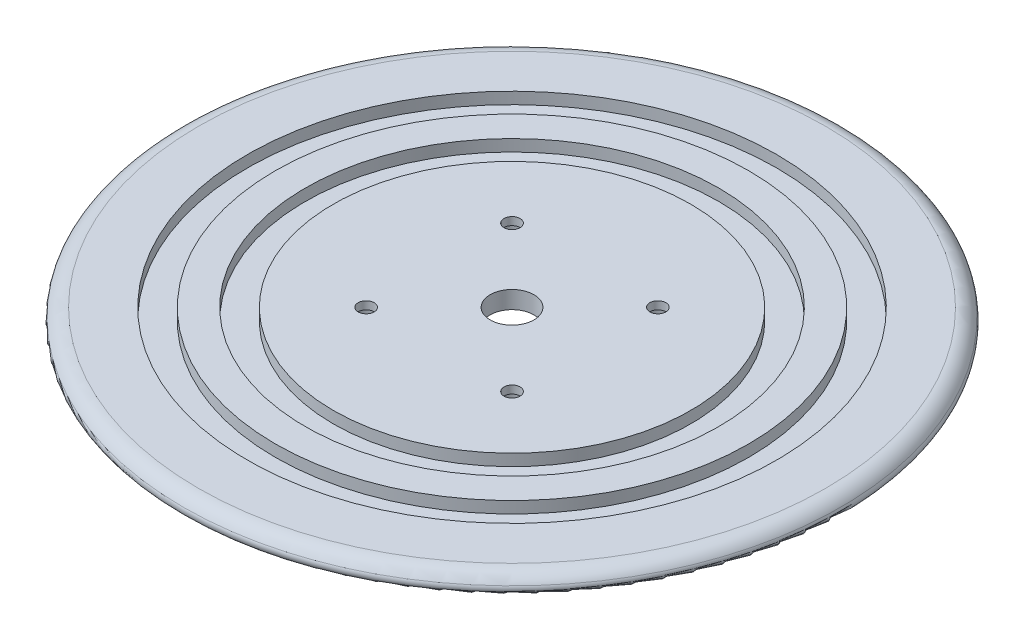
ISO-10303-21;
HEADER;
FILE_DESCRIPTION(('STEP AP214'),'2;1');
FILE_NAME('part.step','',(''),(''),'','','');
FILE_SCHEMA(('AUTOMOTIVE_DESIGN { 1 0 10303 214 1 1 1 1 }'));
ENDSEC;
DATA;
#1=APPLICATION_CONTEXT('core data for automotive mechanical design processes');
#2=APPLICATION_PROTOCOL_DEFINITION('international standard','automotive_design',2000,#1);
#3=PRODUCT_CONTEXT('',#1,'mechanical');
#4=PRODUCT('Part','Part','',(#3));
#5=PRODUCT_RELATED_PRODUCT_CATEGORY('part','',(#4));
#6=PRODUCT_DEFINITION_FORMATION('','',#4);
#7=PRODUCT_DEFINITION_CONTEXT('part definition',#1,'design');
#8=PRODUCT_DEFINITION('design','',#6,#7);
#9=PRODUCT_DEFINITION_SHAPE('','',#8);
#10=(LENGTH_UNIT() NAMED_UNIT(*) SI_UNIT(.MILLI.,.METRE.));
#11=(NAMED_UNIT(*) PLANE_ANGLE_UNIT() SI_UNIT($,.RADIAN.));
#12=(NAMED_UNIT(*) SI_UNIT($,.STERADIAN.) SOLID_ANGLE_UNIT());
#13=UNCERTAINTY_MEASURE_WITH_UNIT(LENGTH_MEASURE(1.E-05),#10,'distance_accuracy_value','');
#14=(GEOMETRIC_REPRESENTATION_CONTEXT(3) GLOBAL_UNCERTAINTY_ASSIGNED_CONTEXT((#13)) GLOBAL_UNIT_ASSIGNED_CONTEXT((#10,
#11,#12)) REPRESENTATION_CONTEXT('',''));
#15=CARTESIAN_POINT('',(0.,0.,0.));
#16=DIRECTION('',(0.,0.,1.));
#17=DIRECTION('',(1.,0.,0.));
#18=AXIS2_PLACEMENT_3D('',#15,#16,#17);
#19=CARTESIAN_POINT('',(0.,0.,0.));
#20=DIRECTION('',(0.,-1.,0.));
#21=DIRECTION('',(0.,0.,-1.));
#22=AXIS2_PLACEMENT_3D('',#19,#20,#21);
#23=PLANE('',#22);
#24=CARTESIAN_POINT('',(0.,0.,0.));
#25=DIRECTION('',(0.,-1.,0.));
#26=DIRECTION('',(0.,0.,-1.));
#27=AXIS2_PLACEMENT_3D('',#24,#25,#26);
#28=CIRCLE('',#27,7.5);
#29=CARTESIAN_POINT('',(0.,0.,-7.5));
#30=VERTEX_POINT('',#29);
#31=EDGE_CURVE('E123',#30,#30,#28,.T.);
#32=ORIENTED_EDGE('',*,*,#31,.T.);
#33=EDGE_LOOP('',(#32));
#34=FACE_BOUND('',#33,.T.);
#35=CARTESIAN_POINT('',(-25.,0.,25.));
#36=DIRECTION('',(0.,-1.,0.));
#37=DIRECTION('',(0.,0.,-1.));
#38=AXIS2_PLACEMENT_3D('',#35,#36,#37);
#39=CIRCLE('',#38,2.75);
#40=CARTESIAN_POINT('',(-25.,0.,22.25));
#41=VERTEX_POINT('',#40);
#42=EDGE_CURVE('E111',#41,#41,#39,.T.);
#43=ORIENTED_EDGE('',*,*,#42,.T.);
#44=EDGE_LOOP('',(#43));
#45=FACE_BOUND('',#44,.T.);
#46=CARTESIAN_POINT('',(25.,0.,25.));
#47=DIRECTION('',(0.,-1.,0.));
#48=DIRECTION('',(0.,0.,-1.));
#49=AXIS2_PLACEMENT_3D('',#46,#47,#48);
#50=CIRCLE('',#49,2.75);
#51=CARTESIAN_POINT('',(25.,0.,22.25));
#52=VERTEX_POINT('',#51);
#53=EDGE_CURVE('E99',#52,#52,#50,.T.);
#54=ORIENTED_EDGE('',*,*,#53,.T.);
#55=EDGE_LOOP('',(#54));
#56=FACE_BOUND('',#55,.T.);
#57=CARTESIAN_POINT('',(25.,0.,-25.));
#58=DIRECTION('',(0.,-1.,0.));
#59=DIRECTION('',(0.,0.,-1.));
#60=AXIS2_PLACEMENT_3D('',#57,#58,#59);
#61=CIRCLE('',#60,2.75);
#62=CARTESIAN_POINT('',(25.,0.,-27.75));
#63=VERTEX_POINT('',#62);
#64=EDGE_CURVE('E87',#63,#63,#61,.T.);
#65=ORIENTED_EDGE('',*,*,#64,.T.);
#66=EDGE_LOOP('',(#65));
#67=FACE_BOUND('',#66,.T.);
#68=CARTESIAN_POINT('',(-25.,0.,-25.));
#69=DIRECTION('',(0.,-1.,0.));
#70=DIRECTION('',(0.,0.,-1.));
#71=AXIS2_PLACEMENT_3D('',#68,#69,#70);
#72=CIRCLE('',#71,2.75);
#73=CARTESIAN_POINT('',(-25.,0.,-27.75));
#74=VERTEX_POINT('',#73);
#75=EDGE_CURVE('E75',#74,#74,#72,.T.);
#76=ORIENTED_EDGE('',*,*,#75,.T.);
#77=EDGE_LOOP('',(#76));
#78=FACE_BOUND('',#77,.T.);
#79=CARTESIAN_POINT('',(0.,0.,0.));
#80=DIRECTION('',(0.,-1.,0.));
#81=DIRECTION('',(0.,0.,-1.));
#82=AXIS2_PLACEMENT_3D('',#79,#80,#81);
#83=CIRCLE('',#82,61.26);
#84=CARTESIAN_POINT('',(0.,0.,-61.26));
#85=VERTEX_POINT('',#84);
#86=EDGE_CURVE('E45',#85,#85,#83,.T.);
#87=ORIENTED_EDGE('',*,*,#86,.F.);
#88=EDGE_LOOP('',(#87));
#89=FACE_BOUND('',#88,.T.);
#90=ADVANCED_FACE('F34',(#34,#45,#56,#67,#78,#89),#23,.F.);
#91=CARTESIAN_POINT('',(0.,-6.,0.));
#92=DIRECTION('',(0.,-1.,0.));
#93=DIRECTION('',(0.,0.,-1.));
#94=AXIS2_PLACEMENT_3D('',#91,#92,#93);
#95=CYLINDRICAL_SURFACE('',#94,61.26);
#96=CARTESIAN_POINT('',(0.,-4.00000000000001,0.));
#97=DIRECTION('',(0.,-1.,0.));
#98=DIRECTION('',(0.,0.,-1.));
#99=AXIS2_PLACEMENT_3D('',#96,#97,#98);
#100=CIRCLE('',#99,61.26);
#101=CARTESIAN_POINT('',(0.,-4.00000000000001,-61.26));
#102=VERTEX_POINT('',#101);
#103=EDGE_CURVE('E49',#102,#102,#100,.T.);
#104=ORIENTED_EDGE('',*,*,#103,.F.);
#105=EDGE_LOOP('',(#104));
#106=FACE_BOUND('',#105,.T.);
#107=ORIENTED_EDGE('',*,*,#86,.T.);
#108=EDGE_LOOP('',(#107));
#109=FACE_BOUND('',#108,.T.);
#110=ADVANCED_FACE('F169',(#106,#109),#95,.T.);
#111=CARTESIAN_POINT('',(-61.26,-4.00000000000001,0.));
#112=DIRECTION('',(0.,-1.,0.));
#113=DIRECTION('',(0.,0.,-1.));
#114=AXIS2_PLACEMENT_3D('',#111,#112,#113);
#115=PLANE('',#114);
#116=CARTESIAN_POINT('',(0.,-4.00000000000001,0.));
#117=DIRECTION('',(0.,-1.,0.));
#118=DIRECTION('',(0.,0.,-1.));
#119=AXIS2_PLACEMENT_3D('',#116,#117,#118);
#120=CIRCLE('',#119,70.86);
#121=CARTESIAN_POINT('',(0.,-4.00000000000001,-70.86));
#122=VERTEX_POINT('',#121);
#123=EDGE_CURVE('E54',#122,#122,#120,.T.);
#124=ORIENTED_EDGE('',*,*,#123,.F.);
#125=EDGE_LOOP('',(#124));
#126=FACE_BOUND('',#125,.T.);
#127=ORIENTED_EDGE('',*,*,#103,.T.);
#128=EDGE_LOOP('',(#127));
#129=FACE_BOUND('',#128,.T.);
#130=ADVANCED_FACE('F173',(#126,#129),#115,.F.);
#131=CARTESIAN_POINT('',(0.,-6.,0.));
#132=DIRECTION('',(0.,-1.,0.));
#133=DIRECTION('',(0.,0.,-1.));
#134=AXIS2_PLACEMENT_3D('',#131,#132,#133);
#135=CYLINDRICAL_SURFACE('',#134,70.86);
#136=CARTESIAN_POINT('',(0.,0.,0.));
#137=DIRECTION('',(0.,-1.,0.));
#138=DIRECTION('',(0.,0.,-1.));
#139=AXIS2_PLACEMENT_3D('',#136,#137,#138);
#140=CIRCLE('',#139,70.86);
#141=CARTESIAN_POINT('',(0.,0.,-70.86));
#142=VERTEX_POINT('',#141);
#143=EDGE_CURVE('E57',#142,#142,#140,.T.);
#144=ORIENTED_EDGE('',*,*,#143,.F.);
#145=EDGE_LOOP('',(#144));
#146=FACE_BOUND('',#145,.T.);
#147=ORIENTED_EDGE('',*,*,#123,.T.);
#148=EDGE_LOOP('',(#147));
#149=FACE_BOUND('',#148,.T.);
#150=ADVANCED_FACE('F179',(#146,#149),#135,.F.);
#151=CARTESIAN_POINT('',(-70.86,0.,0.));
#152=DIRECTION('',(0.,-1.,0.));
#153=DIRECTION('',(0.,0.,-1.));
#154=AXIS2_PLACEMENT_3D('',#151,#152,#153);
#155=PLANE('',#154);
#156=CARTESIAN_POINT('',(0.,0.,0.));
#157=DIRECTION('',(0.,-1.,0.));
#158=DIRECTION('',(0.,0.,-1.));
#159=AXIS2_PLACEMENT_3D('',#156,#157,#158);
#160=CIRCLE('',#159,81.13);
#161=CARTESIAN_POINT('',(0.,0.,-81.13));
#162=VERTEX_POINT('',#161);
#163=EDGE_CURVE('E60',#162,#162,#160,.T.);
#164=ORIENTED_EDGE('',*,*,#163,.F.);
#165=EDGE_LOOP('',(#164));
#166=FACE_BOUND('',#165,.T.);
#167=ORIENTED_EDGE('',*,*,#143,.T.);
#168=EDGE_LOOP('',(#167));
#169=FACE_BOUND('',#168,.T.);
#170=ADVANCED_FACE('F183',(#166,#169),#155,.F.);
#171=CARTESIAN_POINT('',(0.,-6.,0.));
#172=DIRECTION('',(0.,-1.,0.));
#173=DIRECTION('',(0.,0.,-1.));
#174=AXIS2_PLACEMENT_3D('',#171,#172,#173);
#175=CYLINDRICAL_SURFACE('',#174,81.13);
#176=CARTESIAN_POINT('',(0.,-4.,0.));
#177=DIRECTION('',(0.,-1.,0.));
#178=DIRECTION('',(0.,0.,-1.));
#179=AXIS2_PLACEMENT_3D('',#176,#177,#178);
#180=CIRCLE('',#179,81.13);
#181=CARTESIAN_POINT('',(0.,-4.,-81.13));
#182=VERTEX_POINT('',#181);
#183=EDGE_CURVE('E63',#182,#182,#180,.T.);
#184=ORIENTED_EDGE('',*,*,#183,.F.);
#185=EDGE_LOOP('',(#184));
#186=FACE_BOUND('',#185,.T.);
#187=ORIENTED_EDGE('',*,*,#163,.T.);
#188=EDGE_LOOP('',(#187));
#189=FACE_BOUND('',#188,.T.);
#190=ADVANCED_FACE('F187',(#186,#189),#175,.T.);
#191=CARTESIAN_POINT('',(-81.13,-4.00000000000001,0.));
#192=DIRECTION('',(0.,-1.,0.));
#193=DIRECTION('',(0.,0.,-1.));
#194=AXIS2_PLACEMENT_3D('',#191,#192,#193);
#195=PLANE('',#194);
#196=CARTESIAN_POINT('',(0.,-4.00000000000001,0.));
#197=DIRECTION('',(0.,-1.,0.));
#198=DIRECTION('',(0.,0.,-1.));
#199=AXIS2_PLACEMENT_3D('',#196,#197,#198);
#200=CIRCLE('',#199,90.73);
#201=CARTESIAN_POINT('',(0.,-4.00000000000001,-90.73));
#202=VERTEX_POINT('',#201);
#203=EDGE_CURVE('E66',#202,#202,#200,.T.);
#204=ORIENTED_EDGE('',*,*,#203,.F.);
#205=EDGE_LOOP('',(#204));
#206=FACE_BOUND('',#205,.T.);
#207=ORIENTED_EDGE('',*,*,#183,.T.);
#208=EDGE_LOOP('',(#207));
#209=FACE_BOUND('',#208,.T.);
#210=ADVANCED_FACE('F191',(#206,#209),#195,.F.);
#211=CARTESIAN_POINT('',(0.,-6.,0.));
#212=DIRECTION('',(0.,-1.,0.));
#213=DIRECTION('',(0.,0.,-1.));
#214=AXIS2_PLACEMENT_3D('',#211,#212,#213);
#215=CYLINDRICAL_SURFACE('',#214,90.73);
#216=CARTESIAN_POINT('',(0.,0.,0.));
#217=DIRECTION('',(0.,-1.,0.));
#218=DIRECTION('',(0.,0.,-1.));
#219=AXIS2_PLACEMENT_3D('',#216,#217,#218);
#220=CIRCLE('',#219,90.73);
#221=CARTESIAN_POINT('',(0.,0.,-90.73));
#222=VERTEX_POINT('',#221);
#223=EDGE_CURVE('E69',#222,#222,#220,.T.);
#224=ORIENTED_EDGE('',*,*,#223,.F.);
#225=EDGE_LOOP('',(#224));
#226=FACE_BOUND('',#225,.T.);
#227=ORIENTED_EDGE('',*,*,#203,.T.);
#228=EDGE_LOOP('',(#227));
#229=FACE_BOUND('',#228,.T.);
#230=ADVANCED_FACE('F195',(#226,#229),#215,.F.);
#231=CARTESIAN_POINT('',(-90.73,0.,0.));
#232=DIRECTION('',(0.,-1.,0.));
#233=DIRECTION('',(0.,0.,-1.));
#234=AXIS2_PLACEMENT_3D('',#231,#232,#233);
#235=PLANE('',#234);
#236=CARTESIAN_POINT('',(0.,0.,0.));
#237=DIRECTION('',(0.,-1.,0.));
#238=DIRECTION('',(0.,0.,-1.));
#239=AXIS2_PLACEMENT_3D('',#236,#237,#238);
#240=CIRCLE('',#239,107.5);
#241=CARTESIAN_POINT('',(0.,0.,-107.5));
#242=VERTEX_POINT('',#241);
#243=EDGE_CURVE('E72',#242,#242,#240,.T.);
#244=ORIENTED_EDGE('',*,*,#243,.F.);
#245=EDGE_LOOP('',(#244));
#246=FACE_BOUND('',#245,.T.);
#247=ORIENTED_EDGE('',*,*,#223,.T.);
#248=EDGE_LOOP('',(#247));
#249=FACE_BOUND('',#248,.T.);
#250=ADVANCED_FACE('F199',(#246,#249),#235,.F.);
#251=CARTESIAN_POINT('',(0.,-6.,0.));
#252=DIRECTION('',(0.,-1.,0.));
#253=DIRECTION('',(0.,0.,-1.));
#254=AXIS2_PLACEMENT_3D('',#251,#252,#253);
#255=TOROIDAL_SURFACE('',#254,107.5,5.99999999999998);
#256=CARTESIAN_POINT('',(0.,-3.00000000000002,0.));
#257=DIRECTION('',(0.,-1.,0.));
#258=DIRECTION('',(0.,0.,-1.));
#259=AXIS2_PLACEMENT_3D('',#256,#257,#258);
#260=CIRCLE('',#259,112.696152422707);
#261=CARTESIAN_POINT('',(0.,-3.00000000000002,-112.696152422707));
#262=VERTEX_POINT('',#261);
#263=EDGE_CURVE('E10',#262,#262,#260,.F.);
#264=ORIENTED_EDGE('',*,*,#263,.T.);
#265=EDGE_LOOP('',(#264));
#266=FACE_BOUND('',#265,.T.);
#267=ORIENTED_EDGE('',*,*,#243,.T.);
#268=EDGE_LOOP('',(#267));
#269=FACE_BOUND('',#268,.T.);
#270=ADVANCED_FACE('F141',(#266,#269),#255,.T.);
#271=CARTESIAN_POINT('',(-113.5,-6.,0.));
#272=DIRECTION('',(0.,1.,0.));
#273=DIRECTION('',(0.,0.,1.));
#274=AXIS2_PLACEMENT_3D('',#271,#272,#273);
#275=PLANE('',#274);
#276=CARTESIAN_POINT('',(0.,-6.,0.));
#277=DIRECTION('',(0.,-1.,0.));
#278=DIRECTION('',(0.,0.,-1.));
#279=AXIS2_PLACEMENT_3D('',#276,#277,#278);
#280=CIRCLE('',#279,7.5);
#281=CARTESIAN_POINT('',(0.,-6.,-7.5));
#282=VERTEX_POINT('',#281);
#283=EDGE_CURVE('E124',#282,#282,#280,.T.);
#284=ORIENTED_EDGE('',*,*,#283,.F.);
#285=EDGE_LOOP('',(#284));
#286=FACE_BOUND('',#285,.T.);
#287=CARTESIAN_POINT('',(0.,-6.,0.));
#288=DIRECTION('',(0.,1.,0.));
#289=DIRECTION('',(0.,0.,1.));
#290=AXIS2_PLACEMENT_3D('',#287,#288,#289);
#291=CIRCLE('',#290,110.964101615138);
#292=CARTESIAN_POINT('',(0.,-6.,110.964101615138));
#293=VERTEX_POINT('',#292);
#294=EDGE_CURVE('E41',#293,#293,#291,.F.);
#295=ORIENTED_EDGE('',*,*,#294,.T.);
#296=EDGE_LOOP('',(#295));
#297=FACE_BOUND('',#296,.T.);
#298=CARTESIAN_POINT('',(-25.,-6.,25.));
#299=DIRECTION('',(0.,-1.,0.));
#300=DIRECTION('',(0.,0.,-1.));
#301=AXIS2_PLACEMENT_3D('',#298,#299,#300);
#302=CIRCLE('',#301,4.74999999999999);
#303=CARTESIAN_POINT('',(-25.,-6.,20.25));
#304=VERTEX_POINT('',#303);
#305=EDGE_CURVE('E120',#304,#304,#302,.T.);
#306=ORIENTED_EDGE('',*,*,#305,.F.);
#307=EDGE_LOOP('',(#306));
#308=FACE_BOUND('',#307,.T.);
#309=CARTESIAN_POINT('',(25.,-6.,25.));
#310=DIRECTION('',(0.,-1.,0.));
#311=DIRECTION('',(0.,0.,-1.));
#312=AXIS2_PLACEMENT_3D('',#309,#310,#311);
#313=CIRCLE('',#312,4.74999999999999);
#314=CARTESIAN_POINT('',(25.,-6.,20.25));
#315=VERTEX_POINT('',#314);
#316=EDGE_CURVE('E108',#315,#315,#313,.T.);
#317=ORIENTED_EDGE('',*,*,#316,.F.);
#318=EDGE_LOOP('',(#317));
#319=FACE_BOUND('',#318,.T.);
#320=CARTESIAN_POINT('',(25.,-6.,-25.));
#321=DIRECTION('',(0.,-1.,0.));
#322=DIRECTION('',(0.,0.,-1.));
#323=AXIS2_PLACEMENT_3D('',#320,#321,#322);
#324=CIRCLE('',#323,4.74999999999999);
#325=CARTESIAN_POINT('',(25.,-6.,-29.75));
#326=VERTEX_POINT('',#325);
#327=EDGE_CURVE('E96',#326,#326,#324,.T.);
#328=ORIENTED_EDGE('',*,*,#327,.F.);
#329=EDGE_LOOP('',(#328));
#330=FACE_BOUND('',#329,.T.);
#331=CARTESIAN_POINT('',(-25.,-6.,-25.));
#332=DIRECTION('',(0.,-1.,0.));
#333=DIRECTION('',(0.,0.,-1.));
#334=AXIS2_PLACEMENT_3D('',#331,#332,#333);
#335=CIRCLE('',#334,4.74999999999999);
#336=CARTESIAN_POINT('',(-25.,-6.,-29.75));
#337=VERTEX_POINT('',#336);
#338=EDGE_CURVE('E84',#337,#337,#335,.T.);
#339=ORIENTED_EDGE('',*,*,#338,.F.);
#340=EDGE_LOOP('',(#339));
#341=FACE_BOUND('',#340,.T.);
#342=ADVANCED_FACE('F138',(#286,#297,#308,#319,#330,#341),#275,.F.);
#343=CARTESIAN_POINT('',(-25.,-6.,-25.));
#344=DIRECTION('',(0.,-1.,0.));
#345=DIRECTION('',(0.,0.,-1.));
#346=AXIS2_PLACEMENT_3D('',#343,#344,#345);
#347=CYLINDRICAL_SURFACE('',#346,2.75);
#348=ORIENTED_EDGE('',*,*,#75,.F.);
#349=EDGE_LOOP('',(#348));
#350=FACE_BOUND('',#349,.T.);
#351=CARTESIAN_POINT('',(-25.,-2.7,-25.));
#352=DIRECTION('',(0.,-1.,0.));
#353=DIRECTION('',(0.,0.,-1.));
#354=AXIS2_PLACEMENT_3D('',#351,#352,#353);
#355=CIRCLE('',#354,2.75);
#356=CARTESIAN_POINT('',(-25.,-2.7,-27.75));
#357=VERTEX_POINT('',#356);
#358=EDGE_CURVE('E78',#357,#357,#355,.T.);
#359=ORIENTED_EDGE('',*,*,#358,.T.);
#360=EDGE_LOOP('',(#359));
#361=FACE_BOUND('',#360,.T.);
#362=ADVANCED_FACE('F140',(#350,#361),#347,.F.);
#363=CARTESIAN_POINT('',(-22.25,-2.7,-25.));
#364=DIRECTION('',(0.,1.,0.));
#365=DIRECTION('',(0.,0.,1.));
#366=AXIS2_PLACEMENT_3D('',#363,#364,#365);
#367=PLANE('',#366);
#368=ORIENTED_EDGE('',*,*,#358,.F.);
#369=EDGE_LOOP('',(#368));
#370=FACE_BOUND('',#369,.T.);
#371=CARTESIAN_POINT('',(-25.,-2.7,-25.));
#372=DIRECTION('',(0.,-1.,0.));
#373=DIRECTION('',(0.,0.,-1.));
#374=AXIS2_PLACEMENT_3D('',#371,#372,#373);
#375=CIRCLE('',#374,4.75);
#376=CARTESIAN_POINT('',(-25.,-2.7,-29.75));
#377=VERTEX_POINT('',#376);
#378=EDGE_CURVE('E81',#377,#377,#375,.T.);
#379=ORIENTED_EDGE('',*,*,#378,.T.);
#380=EDGE_LOOP('',(#379));
#381=FACE_BOUND('',#380,.T.);
#382=ADVANCED_FACE('F155',(#370,#381),#367,.F.);
#383=CARTESIAN_POINT('',(-25.,-6.,-25.));
#384=DIRECTION('',(0.,-1.,0.));
#385=DIRECTION('',(0.,0.,-1.));
#386=AXIS2_PLACEMENT_3D('',#383,#384,#385);
#387=CYLINDRICAL_SURFACE('',#386,4.75);
#388=ORIENTED_EDGE('',*,*,#378,.F.);
#389=EDGE_LOOP('',(#388));
#390=FACE_BOUND('',#389,.T.);
#391=ORIENTED_EDGE('',*,*,#338,.T.);
#392=EDGE_LOOP('',(#391));
#393=FACE_BOUND('',#392,.T.);
#394=ADVANCED_FACE('F152',(#390,#393),#387,.F.);
#395=CARTESIAN_POINT('',(25.,-6.,-25.));
#396=DIRECTION('',(0.,-1.,0.));
#397=DIRECTION('',(0.,0.,-1.));
#398=AXIS2_PLACEMENT_3D('',#395,#396,#397);
#399=CYLINDRICAL_SURFACE('',#398,2.75);
#400=ORIENTED_EDGE('',*,*,#64,.F.);
#401=EDGE_LOOP('',(#400));
#402=FACE_BOUND('',#401,.T.);
#403=CARTESIAN_POINT('',(25.,-2.7,-25.));
#404=DIRECTION('',(0.,-1.,0.));
#405=DIRECTION('',(0.,0.,-1.));
#406=AXIS2_PLACEMENT_3D('',#403,#404,#405);
#407=CIRCLE('',#406,2.75);
#408=CARTESIAN_POINT('',(25.,-2.7,-27.75));
#409=VERTEX_POINT('',#408);
#410=EDGE_CURVE('E90',#409,#409,#407,.T.);
#411=ORIENTED_EDGE('',*,*,#410,.T.);
#412=EDGE_LOOP('',(#411));
#413=FACE_BOUND('',#412,.T.);
#414=ADVANCED_FACE('F154',(#402,#413),#399,.F.);
#415=CARTESIAN_POINT('',(27.75,-2.7,-25.));
#416=DIRECTION('',(0.,1.,0.));
#417=DIRECTION('',(0.,0.,1.));
#418=AXIS2_PLACEMENT_3D('',#415,#416,#417);
#419=PLANE('',#418);
#420=ORIENTED_EDGE('',*,*,#410,.F.);
#421=EDGE_LOOP('',(#420));
#422=FACE_BOUND('',#421,.T.);
#423=CARTESIAN_POINT('',(25.,-2.7,-25.));
#424=DIRECTION('',(0.,-1.,0.));
#425=DIRECTION('',(0.,0.,-1.));
#426=AXIS2_PLACEMENT_3D('',#423,#424,#425);
#427=CIRCLE('',#426,4.75);
#428=CARTESIAN_POINT('',(25.,-2.7,-29.75));
#429=VERTEX_POINT('',#428);
#430=EDGE_CURVE('E93',#429,#429,#427,.T.);
#431=ORIENTED_EDGE('',*,*,#430,.T.);
#432=EDGE_LOOP('',(#431));
#433=FACE_BOUND('',#432,.T.);
#434=ADVANCED_FACE('F162',(#422,#433),#419,.F.);
#435=CARTESIAN_POINT('',(25.,-6.,-25.));
#436=DIRECTION('',(0.,-1.,0.));
#437=DIRECTION('',(0.,0.,-1.));
#438=AXIS2_PLACEMENT_3D('',#435,#436,#437);
#439=CYLINDRICAL_SURFACE('',#438,4.75);
#440=ORIENTED_EDGE('',*,*,#430,.F.);
#441=EDGE_LOOP('',(#440));
#442=FACE_BOUND('',#441,.T.);
#443=ORIENTED_EDGE('',*,*,#327,.T.);
#444=EDGE_LOOP('',(#443));
#445=FACE_BOUND('',#444,.T.);
#446=ADVANCED_FACE('F244',(#442,#445),#439,.F.);
#447=CARTESIAN_POINT('',(25.,-6.,25.));
#448=DIRECTION('',(0.,-1.,0.));
#449=DIRECTION('',(0.,0.,-1.));
#450=AXIS2_PLACEMENT_3D('',#447,#448,#449);
#451=CYLINDRICAL_SURFACE('',#450,2.75);
#452=ORIENTED_EDGE('',*,*,#53,.F.);
#453=EDGE_LOOP('',(#452));
#454=FACE_BOUND('',#453,.T.);
#455=CARTESIAN_POINT('',(25.,-2.7,25.));
#456=DIRECTION('',(0.,-1.,0.));
#457=DIRECTION('',(0.,0.,-1.));
#458=AXIS2_PLACEMENT_3D('',#455,#456,#457);
#459=CIRCLE('',#458,2.75);
#460=CARTESIAN_POINT('',(25.,-2.7,22.25));
#461=VERTEX_POINT('',#460);
#462=EDGE_CURVE('E102',#461,#461,#459,.T.);
#463=ORIENTED_EDGE('',*,*,#462,.T.);
#464=EDGE_LOOP('',(#463));
#465=FACE_BOUND('',#464,.T.);
#466=ADVANCED_FACE('F254',(#454,#465),#451,.F.);
#467=CARTESIAN_POINT('',(27.75,-2.7,25.));
#468=DIRECTION('',(0.,1.,0.));
#469=DIRECTION('',(0.,0.,1.));
#470=AXIS2_PLACEMENT_3D('',#467,#468,#469);
#471=PLANE('',#470);
#472=ORIENTED_EDGE('',*,*,#462,.F.);
#473=EDGE_LOOP('',(#472));
#474=FACE_BOUND('',#473,.T.);
#475=CARTESIAN_POINT('',(25.,-2.7,25.));
#476=DIRECTION('',(0.,-1.,0.));
#477=DIRECTION('',(0.,0.,-1.));
#478=AXIS2_PLACEMENT_3D('',#475,#476,#477);
#479=CIRCLE('',#478,4.75);
#480=CARTESIAN_POINT('',(25.,-2.7,20.25));
#481=VERTEX_POINT('',#480);
#482=EDGE_CURVE('E105',#481,#481,#479,.T.);
#483=ORIENTED_EDGE('',*,*,#482,.T.);
#484=EDGE_LOOP('',(#483));
#485=FACE_BOUND('',#484,.T.);
#486=ADVANCED_FACE('F264',(#474,#485),#471,.F.);
#487=CARTESIAN_POINT('',(25.,-6.,25.));
#488=DIRECTION('',(0.,-1.,0.));
#489=DIRECTION('',(0.,0.,-1.));
#490=AXIS2_PLACEMENT_3D('',#487,#488,#489);
#491=CYLINDRICAL_SURFACE('',#490,4.75);
#492=ORIENTED_EDGE('',*,*,#482,.F.);
#493=EDGE_LOOP('',(#492));
#494=FACE_BOUND('',#493,.T.);
#495=ORIENTED_EDGE('',*,*,#316,.T.);
#496=EDGE_LOOP('',(#495));
#497=FACE_BOUND('',#496,.T.);
#498=ADVANCED_FACE('F274',(#494,#497),#491,.F.);
#499=CARTESIAN_POINT('',(-25.,-6.,25.));
#500=DIRECTION('',(0.,-1.,0.));
#501=DIRECTION('',(0.,0.,-1.));
#502=AXIS2_PLACEMENT_3D('',#499,#500,#501);
#503=CYLINDRICAL_SURFACE('',#502,2.75);
#504=ORIENTED_EDGE('',*,*,#42,.F.);
#505=EDGE_LOOP('',(#504));
#506=FACE_BOUND('',#505,.T.);
#507=CARTESIAN_POINT('',(-25.,-2.7,25.));
#508=DIRECTION('',(0.,-1.,0.));
#509=DIRECTION('',(0.,0.,-1.));
#510=AXIS2_PLACEMENT_3D('',#507,#508,#509);
#511=CIRCLE('',#510,2.75);
#512=CARTESIAN_POINT('',(-25.,-2.7,22.25));
#513=VERTEX_POINT('',#512);
#514=EDGE_CURVE('E114',#513,#513,#511,.T.);
#515=ORIENTED_EDGE('',*,*,#514,.T.);
#516=EDGE_LOOP('',(#515));
#517=FACE_BOUND('',#516,.T.);
#518=ADVANCED_FACE('F284',(#506,#517),#503,.F.);
#519=CARTESIAN_POINT('',(-22.25,-2.7,25.));
#520=DIRECTION('',(0.,1.,0.));
#521=DIRECTION('',(0.,0.,1.));
#522=AXIS2_PLACEMENT_3D('',#519,#520,#521);
#523=PLANE('',#522);
#524=ORIENTED_EDGE('',*,*,#514,.F.);
#525=EDGE_LOOP('',(#524));
#526=FACE_BOUND('',#525,.T.);
#527=CARTESIAN_POINT('',(-25.,-2.7,25.));
#528=DIRECTION('',(0.,-1.,0.));
#529=DIRECTION('',(0.,0.,-1.));
#530=AXIS2_PLACEMENT_3D('',#527,#528,#529);
#531=CIRCLE('',#530,4.75);
#532=CARTESIAN_POINT('',(-25.,-2.7,20.25));
#533=VERTEX_POINT('',#532);
#534=EDGE_CURVE('E117',#533,#533,#531,.T.);
#535=ORIENTED_EDGE('',*,*,#534,.T.);
#536=EDGE_LOOP('',(#535));
#537=FACE_BOUND('',#536,.T.);
#538=ADVANCED_FACE('F294',(#526,#537),#523,.F.);
#539=CARTESIAN_POINT('',(-25.,-6.,25.));
#540=DIRECTION('',(0.,-1.,0.));
#541=DIRECTION('',(0.,0.,-1.));
#542=AXIS2_PLACEMENT_3D('',#539,#540,#541);
#543=CYLINDRICAL_SURFACE('',#542,4.75);
#544=ORIENTED_EDGE('',*,*,#534,.F.);
#545=EDGE_LOOP('',(#544));
#546=FACE_BOUND('',#545,.T.);
#547=ORIENTED_EDGE('',*,*,#305,.T.);
#548=EDGE_LOOP('',(#547));
#549=FACE_BOUND('',#548,.T.);
#550=ADVANCED_FACE('F304',(#546,#549),#543,.F.);
#551=CARTESIAN_POINT('',(0.,-4.,0.));
#552=DIRECTION('',(0.,1.,0.));
#553=DIRECTION('',(0.,0.,1.));
#554=AXIS2_PLACEMENT_3D('',#551,#552,#553);
#555=TOROIDAL_SURFACE('',#554,110.964101615138,2.);
#556=ORIENTED_EDGE('',*,*,#263,.F.);
#557=EDGE_LOOP('',(#556));
#558=FACE_BOUND('',#557,.T.);
#559=ORIENTED_EDGE('',*,*,#294,.F.);
#560=EDGE_LOOP('',(#559));
#561=FACE_BOUND('',#560,.T.);
#562=ADVANCED_FACE('F36',(#558,#561),#555,.T.);
#563=CARTESIAN_POINT('',(0.,0.,0.));
#564=DIRECTION('',(0.,-1.,0.));
#565=DIRECTION('',(0.,0.,-1.));
#566=AXIS2_PLACEMENT_3D('',#563,#564,#565);
#567=CYLINDRICAL_SURFACE('',#566,7.5);
#568=ORIENTED_EDGE('',*,*,#31,.F.);
#569=EDGE_LOOP('',(#568));
#570=FACE_BOUND('',#569,.T.);
#571=ORIENTED_EDGE('',*,*,#283,.T.);
#572=EDGE_LOOP('',(#571));
#573=FACE_BOUND('',#572,.T.);
#574=ADVANCED_FACE('F132',(#570,#573),#567,.F.);
#575=CLOSED_SHELL('',(#90,#110,#130,#150,#170,#190,#210,#230,#250,#270,#342,#362,#382,#394,#414,
#434,#446,#466,#486,#498,#518,#538,#550,#562,#574));
#576=MANIFOLD_SOLID_BREP('B2',#575);
#577=ADVANCED_BREP_SHAPE_REPRESENTATION('',(#18,#576),#14);
#578=SHAPE_DEFINITION_REPRESENTATION(#9,#577);
ENDSEC;
END-ISO-10303-21;
